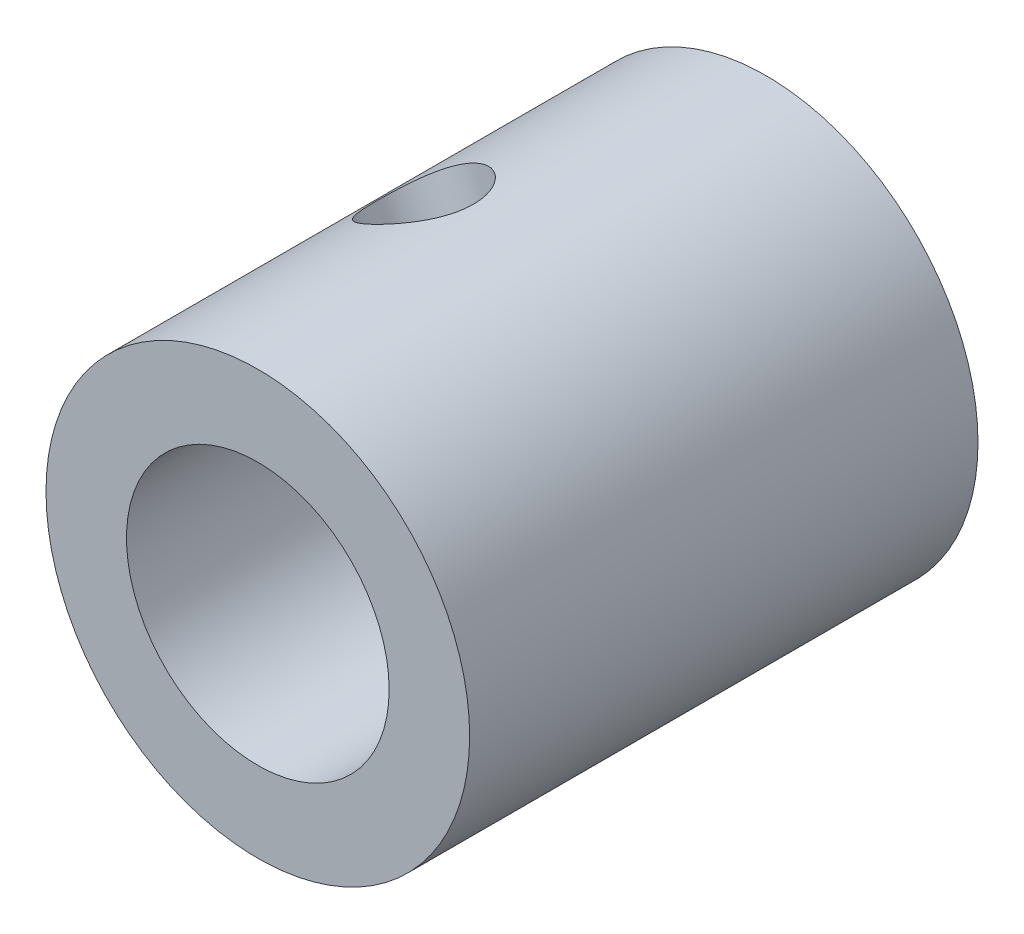
ISO-10303-21;
HEADER;
FILE_DESCRIPTION(('STEP AP214'),'2;1');
FILE_NAME('part.step','',(''),(''),'','','');
FILE_SCHEMA(('AUTOMOTIVE_DESIGN { 1 0 10303 214 1 1 1 1 }'));
ENDSEC;
DATA;
#1=APPLICATION_CONTEXT('core data for automotive mechanical design processes');
#2=APPLICATION_PROTOCOL_DEFINITION('international standard','automotive_design',2000,#1);
#3=PRODUCT_CONTEXT('',#1,'mechanical');
#4=PRODUCT('Part','Part','',(#3));
#5=PRODUCT_RELATED_PRODUCT_CATEGORY('part','',(#4));
#6=PRODUCT_DEFINITION_FORMATION('','',#4);
#7=PRODUCT_DEFINITION_CONTEXT('part definition',#1,'design');
#8=PRODUCT_DEFINITION('design','',#6,#7);
#9=PRODUCT_DEFINITION_SHAPE('','',#8);
#10=(LENGTH_UNIT() NAMED_UNIT(*) SI_UNIT(.MILLI.,.METRE.));
#11=(NAMED_UNIT(*) PLANE_ANGLE_UNIT() SI_UNIT($,.RADIAN.));
#12=(NAMED_UNIT(*) SI_UNIT($,.STERADIAN.) SOLID_ANGLE_UNIT());
#13=UNCERTAINTY_MEASURE_WITH_UNIT(LENGTH_MEASURE(1.E-05),#10,'distance_accuracy_value','');
#14=(GEOMETRIC_REPRESENTATION_CONTEXT(3) GLOBAL_UNCERTAINTY_ASSIGNED_CONTEXT((#13)) GLOBAL_UNIT_ASSIGNED_CONTEXT((#10,
#11,#12)) REPRESENTATION_CONTEXT('',''));
#15=CARTESIAN_POINT('',(0.,0.,0.));
#16=DIRECTION('',(0.,0.,1.));
#17=DIRECTION('',(1.,0.,0.));
#18=AXIS2_PLACEMENT_3D('',#15,#16,#17);
#19=CARTESIAN_POINT('',(0.,0.,12.));
#20=DIRECTION('',(0.,0.,1.));
#21=DIRECTION('',(1.,0.,0.));
#22=AXIS2_PLACEMENT_3D('',#19,#20,#21);
#23=PLANE('',#22);
#24=CARTESIAN_POINT('',(0.,0.,12.));
#25=DIRECTION('',(0.,0.,1.));
#26=DIRECTION('',(1.,0.,0.));
#27=AXIS2_PLACEMENT_3D('',#24,#25,#26);
#28=CIRCLE('',#27,5.);
#29=CARTESIAN_POINT('',(5.,0.,12.));
#30=VERTEX_POINT('',#29);
#31=EDGE_CURVE('E46',#30,#30,#28,.T.);
#32=ORIENTED_EDGE('',*,*,#31,.T.);
#33=EDGE_LOOP('',(#32));
#34=FACE_BOUND('',#33,.T.);
#35=CARTESIAN_POINT('',(0.,0.,12.));
#36=DIRECTION('',(0.,0.,1.));
#37=DIRECTION('',(1.,0.,0.));
#38=AXIS2_PLACEMENT_3D('',#35,#36,#37);
#39=CIRCLE('',#38,3.1);
#40=CARTESIAN_POINT('',(3.1,0.,12.));
#41=VERTEX_POINT('',#40);
#42=EDGE_CURVE('E55',#41,#41,#39,.T.);
#43=ORIENTED_EDGE('',*,*,#42,.F.);
#44=EDGE_LOOP('',(#43));
#45=FACE_BOUND('',#44,.T.);
#46=ADVANCED_FACE('F34',(#34,#45),#23,.T.);
#47=CARTESIAN_POINT('',(0.,0.,0.));
#48=DIRECTION('',(0.,0.,1.));
#49=DIRECTION('',(1.,0.,0.));
#50=AXIS2_PLACEMENT_3D('',#47,#48,#49);
#51=PLANE('',#50);
#52=CARTESIAN_POINT('',(0.,0.,0.));
#53=DIRECTION('',(0.,0.,1.));
#54=DIRECTION('',(1.,0.,0.));
#55=AXIS2_PLACEMENT_3D('',#52,#53,#54);
#56=CIRCLE('',#55,5.);
#57=CARTESIAN_POINT('',(5.,0.,0.));
#58=VERTEX_POINT('',#57);
#59=EDGE_CURVE('E50',#58,#58,#56,.T.);
#60=ORIENTED_EDGE('',*,*,#59,.F.);
#61=EDGE_LOOP('',(#60));
#62=FACE_BOUND('',#61,.T.);
#63=CARTESIAN_POINT('',(0.,0.,0.));
#64=DIRECTION('',(0.,0.,1.));
#65=DIRECTION('',(1.,0.,0.));
#66=AXIS2_PLACEMENT_3D('',#63,#64,#65);
#67=CIRCLE('',#66,3.1);
#68=CARTESIAN_POINT('',(3.1,0.,0.));
#69=VERTEX_POINT('',#68);
#70=EDGE_CURVE('E57',#69,#69,#67,.T.);
#71=ORIENTED_EDGE('',*,*,#70,.T.);
#72=EDGE_LOOP('',(#71));
#73=FACE_BOUND('',#72,.T.);
#74=ADVANCED_FACE('F82',(#62,#73),#51,.F.);
#75=CARTESIAN_POINT('',(0.,0.,12.));
#76=DIRECTION('',(0.,0.,-1.));
#77=DIRECTION('',(-1.,0.,0.));
#78=AXIS2_PLACEMENT_3D('',#75,#76,#77);
#79=CYLINDRICAL_SURFACE('',#78,5.);
#80=CARTESIAN_POINT('',(-3.17621495116273,3.86156167683624,6.));
#81=CARTESIAN_POINT('',(-3.17621372963719,3.861563698836,5.9309746245377));
#82=CARTESIAN_POINT('',(-3.17164366482703,3.86533556108575,5.861927550661));
#83=CARTESIAN_POINT('',(-3.15345952870593,3.88018376208283,5.72581621091298));
#84=CARTESIAN_POINT('',(-3.13984019383281,3.89126435196802,5.65875312276584));
#85=CARTESIAN_POINT('',(-3.10387024983731,3.9200146666412,5.52859823090648));
#86=CARTESIAN_POINT('',(-3.08153091179003,3.93767588427851,5.46550142230716));
#87=CARTESIAN_POINT('',(-3.02855745345807,3.97856186917394,5.34484457373004));
#88=CARTESIAN_POINT('',(-2.99792298101318,4.00178687263126,5.28728476895989));
#89=CARTESIAN_POINT('',(-2.92822353597462,4.05307426760479,5.1780691773689));
#90=CARTESIAN_POINT('',(-2.88900334618941,4.08122349885792,5.12655319982498));
#91=CARTESIAN_POINT('',(-2.80322467063329,4.14060964252628,5.03211930281983));
#92=CARTESIAN_POINT('',(-2.756665499533,4.17184684320085,4.98920218718913));
#93=CARTESIAN_POINT('',(-2.65641548526211,4.23639642020067,4.91261226618436));
#94=CARTESIAN_POINT('',(-2.60263419613389,4.26973167044647,4.87907680591927));
#95=CARTESIAN_POINT('',(-2.48967266933078,4.33656897448706,4.82309517792346));
#96=CARTESIAN_POINT('',(-2.43049322976197,4.3700710029338,4.80064737404224));
#97=CARTESIAN_POINT('',(-2.30950514665481,4.43517842177993,4.76792608271071));
#98=CARTESIAN_POINT('',(-2.24777405304768,4.46680848560537,4.75741517783671));
#99=CARTESIAN_POINT('',(-2.12232545337478,4.52775822463,4.74812081036223));
#100=CARTESIAN_POINT('',(-2.05860824238267,4.55707824076679,4.7493356138952));
#101=CARTESIAN_POINT('',(-1.93251715542218,4.61194135053006,4.76328742512507));
#102=CARTESIAN_POINT('',(-1.87014484424031,4.63755381581212,4.77576816252693));
#103=CARTESIAN_POINT('',(-1.7471671928101,4.68527052166449,4.81148563502425));
#104=CARTESIAN_POINT('',(-1.68656194680468,4.707374575399,4.83472294268871));
#105=CARTESIAN_POINT('',(-1.56838181733808,4.74806520703056,4.89150128534353));
#106=CARTESIAN_POINT('',(-1.51083926244912,4.7666181982857,4.92513352233088));
#107=CARTESIAN_POINT('',(-1.40109700620954,4.80002317524792,5.00167783955813));
#108=CARTESIAN_POINT('',(-1.34889823672501,4.81487451609518,5.04459153428031));
#109=CARTESIAN_POINT('',(-1.25011550611604,4.84147726111903,5.13985437099119));
#110=CARTESIAN_POINT('',(-1.20372174339827,4.85313388795051,5.19242744617389));
#111=CARTESIAN_POINT('',(-1.11982057297443,4.87317841970066,5.30479998677013));
#112=CARTESIAN_POINT('',(-1.08231358061355,4.88156617185218,5.3645997897455));
#113=CARTESIAN_POINT('',(-1.01741317160508,4.89550637790326,5.49014501707448));
#114=CARTESIAN_POINT('',(-0.990069676548219,4.90104488650944,5.5559178651566));
#115=CARTESIAN_POINT('',(-0.946889608943429,4.90957123781671,5.69129273403823));
#116=CARTESIAN_POINT('',(-0.931050574000862,4.91255962636502,5.76089393199157));
#117=CARTESIAN_POINT('',(-0.911839079227677,4.91616143745762,5.89997975076156));
#118=CARTESIAN_POINT('',(-0.908148399504511,4.91683550328933,5.96941889666482));
#119=CARTESIAN_POINT('',(-0.912501594375578,4.91602947200394,6.10791096828908));
#120=CARTESIAN_POINT('',(-0.920544388761994,4.91454957318529,6.17696392897562));
#121=CARTESIAN_POINT('',(-0.947781485728692,4.90936810836058,6.31155713247735));
#122=CARTESIAN_POINT('',(-0.966791179443126,4.9057032884125,6.37713636328542));
#123=CARTESIAN_POINT('',(-1.01505361608842,4.89594408391133,6.50421572892584));
#124=CARTESIAN_POINT('',(-1.04430757239556,4.88984941154381,6.56571537952767));
#125=CARTESIAN_POINT('',(-1.11265203291153,4.8747563431417,6.68422063893368));
#126=CARTESIAN_POINT('',(-1.1519242447278,4.86570332961574,6.74111442002155));
#127=CARTESIAN_POINT('',(-1.23864949078432,4.84435110971322,6.84759418140068));
#128=CARTESIAN_POINT('',(-1.28610386936612,4.83205136971833,6.89717895832504));
#129=CARTESIAN_POINT('',(-1.38895097628278,4.80351208213118,6.98890552128548));
#130=CARTESIAN_POINT('',(-1.444512622578,4.78718165606652,7.03083003127441));
#131=CARTESIAN_POINT('',(-1.56084539513907,4.75052368573378,7.10446793347562));
#132=CARTESIAN_POINT('',(-1.6216162494668,4.73019635004618,7.1361818583041));
#133=CARTESIAN_POINT('',(-1.74596761075248,4.68571461180385,7.18822301726396));
#134=CARTESIAN_POINT('',(-1.80952421364466,4.66158940303468,7.20863214218953));
#135=CARTESIAN_POINT('',(-1.93783250474403,4.60972752757103,7.23773016730421));
#136=CARTESIAN_POINT('',(-2.00258395986642,4.58199155898228,7.24642132936953));
#137=CARTESIAN_POINT('',(-2.12950660795312,4.52437056130001,7.25170948696942));
#138=CARTESIAN_POINT('',(-2.19170022883591,4.49456391670458,7.24862713636924));
#139=CARTESIAN_POINT('',(-2.31352759585518,4.43308539583929,7.23119021588208));
#140=CARTESIAN_POINT('',(-2.37316141806731,4.40141357506778,7.21683598123362));
#141=CARTESIAN_POINT('',(-2.48800314009,4.33752681939966,7.17743472528634));
#142=CARTESIAN_POINT('',(-2.54323313810142,4.30531572616997,7.15244568335672));
#143=CARTESIAN_POINT('',(-2.64837139016153,4.24145222576985,7.09253677622584));
#144=CARTESIAN_POINT('',(-2.69827897226972,4.20979988956091,7.05761565916304));
#145=CARTESIAN_POINT('',(-2.79289355045772,4.14765344827472,6.97785595750366));
#146=CARTESIAN_POINT('',(-2.83744731102997,4.11720525784352,6.93279982136578));
#147=CARTESIAN_POINT('',(-2.91909323686279,4.05972820913403,6.83447143503275));
#148=CARTESIAN_POINT('',(-2.95618350768144,4.03270021964267,6.78119710487762));
#149=CARTESIAN_POINT('',(-3.02283488327876,3.98299312774155,6.66674823224833));
#150=CARTESIAN_POINT('',(-3.05224261538427,3.96040456481245,6.60544484573421));
#151=CARTESIAN_POINT('',(-3.1020071996568,3.92155009318139,6.47743063759662));
#152=CARTESIAN_POINT('',(-3.12237063722689,3.9052795852161,6.41072379236657));
#153=CARTESIAN_POINT('',(-3.15067686391826,3.88246019883191,6.2867787352166));
#154=CARTESIAN_POINT('',(-3.16023968055428,3.87465518620561,6.23013354452017));
#155=CARTESIAN_POINT('',(-3.17300896485896,3.86420529812835,6.11566391375005));
#156=CARTESIAN_POINT('',(-3.17621597473583,3.86155998250854,6.05783957469367));
#157=CARTESIAN_POINT('',(-3.17621495116273,3.86156167683624,6.));
#158=B_SPLINE_CURVE_WITH_KNOTS('',3,(#80,#81,#82,#83,#84,#85,#86,#87,#88,#89,#90,#91,#92,#93,
#94,#95,#96,#97,#98,#99,#100,#101,#102,#103,#104,#105,#106,#107,#108,#109,#110,#111,#112,#113,
#114,#115,#116,#117,#118,#119,#120,#121,#122,#123,#124,#125,#126,#127,#128,#129,#130,#131,#132,
#133,#134,#135,#136,#137,#138,#139,#140,#141,#142,#143,#144,#145,#146,#147,#148,#149,#150,#151,
#152,#153,#154,#155,#156,#157),.UNSPECIFIED.,.T.,.F.,(4,2,2,2,2,2,2,2,2,2,2,2,2,2,2,2,2,2,2,2,2,
2,2,2,2,2,2,2,2,2,2,2,2,2,2,2,2,2,4),(0.,0.206863720868068,0.413847870714333,0.620565363583012,
0.827291633777393,1.03811977096488,1.24896760739933,1.4627574819896,1.67651579923546,
1.88594375497673,2.0953407433301,2.30009131344473,2.50485278362393,2.71146437127222,
2.91811192734456,3.13035233285956,3.34260265599901,3.55588216004201,3.76911600064773,
3.97671787380858,4.18430063591901,4.38848702504603,4.59269760710708,4.80091422929578,
5.00916509442522,5.22262665482659,5.43607707859776,5.64796036403464,5.85980274454519,
6.06591723063728,6.2720255868849,6.47702438279855,6.68204902869036,6.89198548291035,
7.10197515782754,7.31588238642338,7.52963360683309,7.70298913588664,7.87632987549759),.UNSPECIFIED.);
#159=CARTESIAN_POINT('',(-3.17621495116273,3.86156167683624,6.));
#160=VERTEX_POINT('',#159);
#161=EDGE_CURVE('E10',#160,#160,#158,.T.);
#162=ORIENTED_EDGE('',*,*,#161,.T.);
#163=EDGE_LOOP('',(#162));
#164=FACE_BOUND('',#163,.T.);
#165=ORIENTED_EDGE('',*,*,#31,.F.);
#166=EDGE_LOOP('',(#165));
#167=FACE_BOUND('',#166,.T.);
#168=ORIENTED_EDGE('',*,*,#59,.T.);
#169=EDGE_LOOP('',(#168));
#170=FACE_BOUND('',#169,.T.);
#171=ADVANCED_FACE('F36',(#164,#167,#170),#79,.T.);
#172=CARTESIAN_POINT('',(0.,0.,12.));
#173=DIRECTION('',(0.,0.,-1.));
#174=DIRECTION('',(-1.,0.,0.));
#175=AXIS2_PLACEMENT_3D('',#172,#173,#174);
#176=CYLINDRICAL_SURFACE('',#175,3.1);
#177=CARTESIAN_POINT('',(-2.33036416354315,2.04435879073949,6.));
#178=CARTESIAN_POINT('',(-2.33036087274886,2.04436704442065,5.93311169266687));
#179=CARTESIAN_POINT('',(-2.32647879439899,2.04881447420913,5.8661056639948));
#180=CARTESIAN_POINT('',(-2.31100724252014,2.06624606102538,5.73401438578128));
#181=CARTESIAN_POINT('',(-2.29939624367349,2.07925405838588,5.66893503229482));
#182=CARTESIAN_POINT('',(-2.26872546973579,2.11267438222329,5.54284057954936));
#183=CARTESIAN_POINT('',(-2.2496947419159,2.13305781272463,5.48181070430188));
#184=CARTESIAN_POINT('',(-2.20444665779346,2.17978630668726,5.36497402549278));
#185=CARTESIAN_POINT('',(-2.17823132007358,2.20612969528095,5.30916576077028));
#186=CARTESIAN_POINT('',(-2.11728582493036,2.26472445039477,5.20107250413798));
#187=CARTESIAN_POINT('',(-2.08217944562926,2.29721416658662,5.14912867278537));
#188=CARTESIAN_POINT('',(-2.00457007393181,2.36523994717345,5.05336481656005));
#189=CARTESIAN_POINT('',(-1.96206434464116,2.40077713630058,5.0095478100924));
#190=CARTESIAN_POINT('',(-1.86825048091369,2.4745375607317,4.92958097866854));
#191=CARTESIAN_POINT('',(-1.81665734977429,2.51281135090851,4.89380983333444));
#192=CARTESIAN_POINT('',(-1.70682004262221,2.58866951978364,4.83350675082844));
#193=CARTESIAN_POINT('',(-1.64857865454578,2.62625417984927,4.80897012395221));
#194=CARTESIAN_POINT('',(-1.52983166722931,2.69706433058623,4.77305311904463));
#195=CARTESIAN_POINT('',(-1.46957771003194,2.73041325205069,4.76108584110306));
#196=CARTESIAN_POINT('',(-1.34602437425511,2.79338841963652,4.74875613894309));
#197=CARTESIAN_POINT('',(-1.28272615779037,2.82301607095858,4.74838932103613));
#198=CARTESIAN_POINT('',(-1.15878203070887,2.87602354727952,4.75895191133005));
#199=CARTESIAN_POINT('',(-1.09819088515903,2.89966342062455,4.76923791043818));
#200=CARTESIAN_POINT('',(-0.977917087454181,2.94240604889916,4.79971812753932));
#201=CARTESIAN_POINT('',(-0.918234502328898,2.96150847057857,4.81991307295471));
#202=CARTESIAN_POINT('',(-0.800618554393615,2.99546602345797,4.86988470956499));
#203=CARTESIAN_POINT('',(-0.742725276540334,3.01025257883233,4.8998016407588));
#204=CARTESIAN_POINT('',(-0.631254972610295,3.03558717082479,4.96823551727513));
#205=CARTESIAN_POINT('',(-0.577679444374251,3.04613374159634,5.00675542967156));
#206=CARTESIAN_POINT('',(-0.47293526799918,3.06420345024771,5.09428998287082));
#207=CARTESIAN_POINT('',(-0.422164430962193,3.07147850536106,5.14383264516762));
#208=CARTESIAN_POINT('',(-0.328870657606386,3.08286518834929,5.25050188043384));
#209=CARTESIAN_POINT('',(-0.286350510931517,3.08697574766446,5.30763100750707));
#210=CARTESIAN_POINT('',(-0.210121676412685,3.09311461077622,5.42996516385569));
#211=CARTESIAN_POINT('',(-0.17670544373494,3.09507883282817,5.4953568391982));
#212=CARTESIAN_POINT('',(-0.12211075946559,3.09771608404837,5.63108237869799));
#213=CARTESIAN_POINT('',(-0.10092420691131,3.09838996862572,5.70141293661402));
#214=CARTESIAN_POINT('',(-0.0729954903996166,3.09917023854828,5.8403733578032));
#215=CARTESIAN_POINT('',(-0.0654411270317108,3.09930914015627,5.90883944692303));
#216=CARTESIAN_POINT('',(-0.0627379994427134,3.09936572712016,6.04600600507043));
#217=CARTESIAN_POINT('',(-0.0675853767046803,3.0992834812806,6.11470639455904));
#218=CARTESIAN_POINT('',(-0.0887227482491344,3.09874596554981,6.24618046326118));
#219=CARTESIAN_POINT('',(-0.104329455533968,3.09831271316043,6.30906621546969));
#220=CARTESIAN_POINT('',(-0.145438370415237,3.09665427920538,6.43149683460419));
#221=CARTESIAN_POINT('',(-0.17094279486873,3.09542892018539,6.49104094965945));
#222=CARTESIAN_POINT('',(-0.231961530010814,3.09146604262155,6.60781622969609));
#223=CARTESIAN_POINT('',(-0.267842729320456,3.08866870011359,6.66485305452123));
#224=CARTESIAN_POINT('',(-0.347754274262148,3.08069434054998,6.77272274188474));
#225=CARTESIAN_POINT('',(-0.391787978617666,3.07551634138659,6.82355303303828));
#226=CARTESIAN_POINT('',(-0.490185364555232,3.06143203341327,6.92154565981122));
#227=CARTESIAN_POINT('',(-0.54507718001192,3.0522743731733,6.96814370342327));
#228=CARTESIAN_POINT('',(-0.660872440605924,3.02931139964652,7.05176911167595));
#229=CARTESIAN_POINT('',(-0.721776167166403,3.01550586871558,7.08879602798932));
#230=CARTESIAN_POINT('',(-0.847648820106277,2.98256925642351,7.15210833880596));
#231=CARTESIAN_POINT('',(-0.912618796788517,2.96343679469107,7.17839094476546));
#232=CARTESIAN_POINT('',(-1.04435749509133,2.91961035850201,7.21913900955707));
#233=CARTESIAN_POINT('',(-1.11112520048434,2.89491947034657,7.23361100565193));
#234=CARTESIAN_POINT('',(-1.23966057163539,2.842137982764,7.24954225644631));
#235=CARTESIAN_POINT('',(-1.30146684621907,2.8143802826915,7.25179891968263));
#236=CARTESIAN_POINT('',(-1.42264872355923,2.75510751811186,7.24534847708212));
#237=CARTESIAN_POINT('',(-1.48202470472799,2.72359304157165,7.23664308486442));
#238=CARTESIAN_POINT('',(-1.59487875520783,2.65903355190696,7.2090862800553));
#239=CARTESIAN_POINT('',(-1.64848392713142,2.62606840416611,7.19056426970433));
#240=CARTESIAN_POINT('',(-1.75075465089264,2.55902340711422,7.14424837899284));
#241=CARTESIAN_POINT('',(-1.7994192329154,2.52494334067911,7.11645268282297));
#242=CARTESIAN_POINT('',(-1.89308078645777,2.4555636821259,7.05098845507583));
#243=CARTESIAN_POINT('',(-1.93781862307105,2.4202772080653,7.0129360336464));
#244=CARTESIAN_POINT('',(-2.0205455777964,2.35165666165899,6.92861286057926));
#245=CARTESIAN_POINT('',(-2.05853238955907,2.31832325913708,6.88233931111606));
#246=CARTESIAN_POINT('',(-2.1295850045634,2.25329369049583,6.77944386136866));
#247=CARTESIAN_POINT('',(-2.16219062105917,2.22183260591536,6.72235395719591));
#248=CARTESIAN_POINT('',(-2.21907469052531,2.16502438836755,6.60131361681762));
#249=CARTESIAN_POINT('',(-2.24334863350977,2.13968056890909,6.53735948947472));
#250=CARTESIAN_POINT('',(-2.28304477792212,2.09727147968679,6.40483352220449));
#251=CARTESIAN_POINT('',(-2.29854328374273,2.08013505277104,6.33630746776383));
#252=CARTESIAN_POINT('',(-2.32067802481132,2.05541743962449,6.19630615936533));
#253=CARTESIAN_POINT('',(-2.32734399669302,2.04780419640854,6.1248416406824));
#254=CARTESIAN_POINT('',(-2.33009295862281,2.04466679723659,6.03547913577591));
#255=CARTESIAN_POINT('',(-2.33036503650438,2.04435660125482,6.0177437099218));
#256=CARTESIAN_POINT('',(-2.33036416354315,2.04435879073949,6.));
#257=B_SPLINE_CURVE_WITH_KNOTS('',3,(#177,#178,#179,#180,#181,#182,#183,#184,#185,#186,#187,
#188,#189,#190,#191,#192,#193,#194,#195,#196,#197,#198,#199,#200,#201,#202,#203,#204,#205,#206,
#207,#208,#209,#210,#211,#212,#213,#214,#215,#216,#217,#218,#219,#220,#221,#222,#223,#224,#225,
#226,#227,#228,#229,#230,#231,#232,#233,#234,#235,#236,#237,#238,#239,#240,#241,#242,#243,#244,
#245,#246,#247,#248,#249,#250,#251,#252,#253,#254,#255,#256),.UNSPECIFIED.,.T.,.F.,(4,2,2,2,2,2,
2,2,2,2,2,2,2,2,2,2,2,2,2,2,2,2,2,2,2,2,2,2,2,2,2,2,2,2,2,2,2,2,2,4),(0.,0.200616772806554,
0.401794621227473,0.602192667534339,0.802534467773481,1.0134446797003,1.22443307015011,
1.44389657291873,1.66326837977819,1.87186737260608,2.08038735736116,2.27700843709267,
2.47364395306939,2.67325217847935,2.8729293531807,3.0859024208087,3.29894737184451,
3.51819259595185,3.73729242446857,3.94284349521376,4.14833062123893,4.34184286664486,
4.53539847930389,4.73687414010153,4.9384329916439,5.15516713532698,5.3719114293529,
5.58871194083714,5.8053923700385,6.00774050992245,6.21005702210643,6.40597853296097,
6.6019384282405,6.80660771166482,7.01134678230983,7.22897162061836,7.44671407548733,
7.66253293054803,7.87762332284003,7.93084167989007),.UNSPECIFIED.);
#258=CARTESIAN_POINT('',(-2.33036416354315,2.04435879073949,6.));
#259=VERTEX_POINT('',#258);
#260=EDGE_CURVE('E60',#259,#259,#257,.T.);
#261=ORIENTED_EDGE('',*,*,#260,.F.);
#262=EDGE_LOOP('',(#261));
#263=FACE_BOUND('',#262,.T.);
#264=ORIENTED_EDGE('',*,*,#42,.T.);
#265=EDGE_LOOP('',(#264));
#266=FACE_BOUND('',#265,.T.);
#267=ORIENTED_EDGE('',*,*,#70,.F.);
#268=EDGE_LOOP('',(#267));
#269=FACE_BOUND('',#268,.T.);
#270=ADVANCED_FACE('F68',(#263,#266,#269),#176,.F.);
#271=CARTESIAN_POINT('',(-2.109966483248,4.53299475397557,6.));
#272=DIRECTION('',(-0.421993296649601,0.906598950795114,0.));
#273=DIRECTION('',(-0.906598950795114,-0.421993296649601,0.));
#274=AXIS2_PLACEMENT_3D('',#271,#272,#273);
#275=CYLINDRICAL_SURFACE('',#274,1.25);
#276=ORIENTED_EDGE('',*,*,#260,.T.);
#277=EDGE_LOOP('',(#276));
#278=FACE_BOUND('',#277,.T.);
#279=ORIENTED_EDGE('',*,*,#161,.F.);
#280=EDGE_LOOP('',(#279));
#281=FACE_BOUND('',#280,.T.);
#282=ADVANCED_FACE('F71',(#278,#281),#275,.F.);
#283=CLOSED_SHELL('',(#46,#74,#171,#270,#282));
#284=MANIFOLD_SOLID_BREP('B2',#283);
#285=ADVANCED_BREP_SHAPE_REPRESENTATION('',(#18,#284),#14);
#286=SHAPE_DEFINITION_REPRESENTATION(#9,#285);
ENDSEC;
END-ISO-10303-21;
